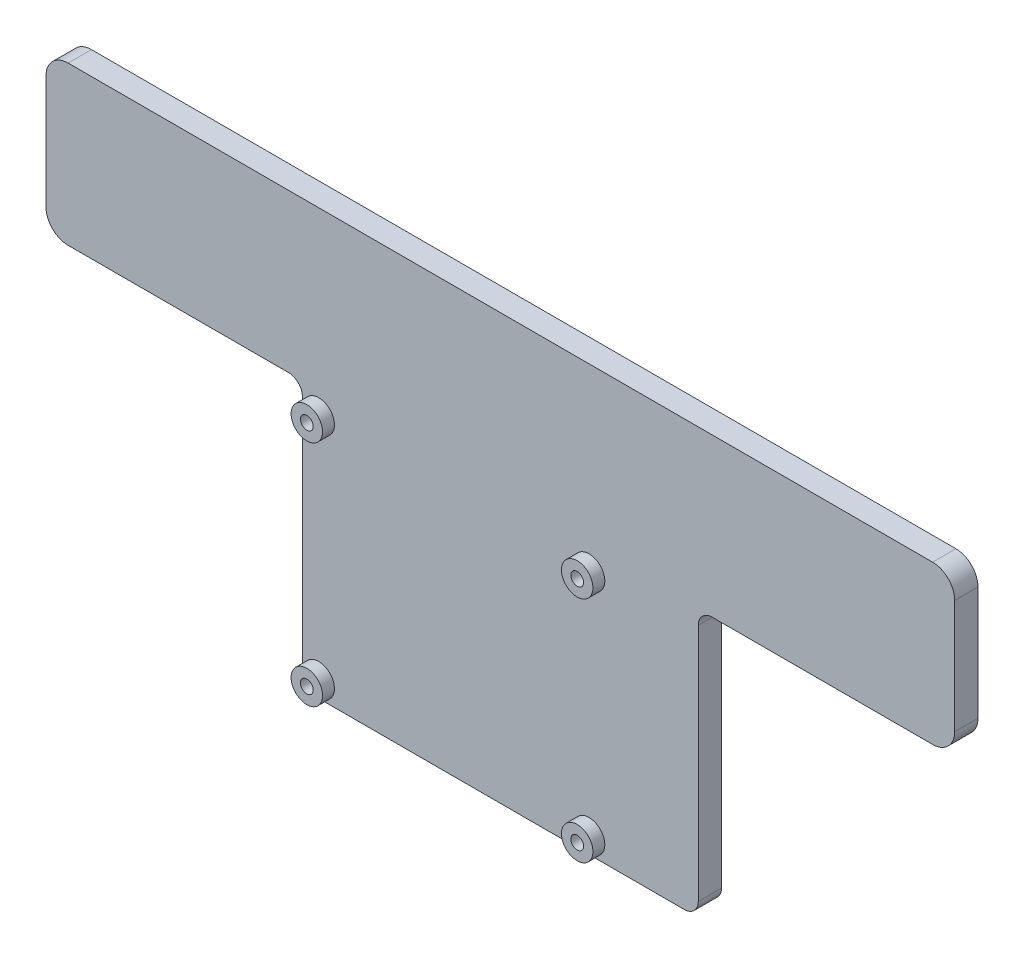
ISO-10303-21;
HEADER;
FILE_DESCRIPTION(('STEP AP214'),'2;1');
FILE_NAME('part.step','',(''),(''),'','','');
FILE_SCHEMA(('AUTOMOTIVE_DESIGN { 1 0 10303 214 1 1 1 1 }'));
ENDSEC;
DATA;
#1=APPLICATION_CONTEXT('core data for automotive mechanical design processes');
#2=APPLICATION_PROTOCOL_DEFINITION('international standard','automotive_design',2000,#1);
#3=PRODUCT_CONTEXT('',#1,'mechanical');
#4=PRODUCT('Part','Part','',(#3));
#5=PRODUCT_RELATED_PRODUCT_CATEGORY('part','',(#4));
#6=PRODUCT_DEFINITION_FORMATION('','',#4);
#7=PRODUCT_DEFINITION_CONTEXT('part definition',#1,'design');
#8=PRODUCT_DEFINITION('design','',#6,#7);
#9=PRODUCT_DEFINITION_SHAPE('','',#8);
#10=(LENGTH_UNIT() NAMED_UNIT(*) SI_UNIT(.MILLI.,.METRE.));
#11=(NAMED_UNIT(*) PLANE_ANGLE_UNIT() SI_UNIT($,.RADIAN.));
#12=(NAMED_UNIT(*) SI_UNIT($,.STERADIAN.) SOLID_ANGLE_UNIT());
#13=UNCERTAINTY_MEASURE_WITH_UNIT(LENGTH_MEASURE(1.E-05),#10,'distance_accuracy_value','');
#14=(GEOMETRIC_REPRESENTATION_CONTEXT(3) GLOBAL_UNCERTAINTY_ASSIGNED_CONTEXT((#13)) GLOBAL_UNIT_ASSIGNED_CONTEXT((#10,
#11,#12)) REPRESENTATION_CONTEXT('',''));
#15=CARTESIAN_POINT('',(0.,0.,0.));
#16=DIRECTION('',(0.,0.,1.));
#17=DIRECTION('',(1.,0.,0.));
#18=AXIS2_PLACEMENT_3D('',#15,#16,#17);
#19=CARTESIAN_POINT('',(-93.2870449166028,36.0396133550613,5.));
#20=DIRECTION('',(0.,0.,1.));
#21=DIRECTION('',(1.,0.,0.));
#22=AXIS2_PLACEMENT_3D('',#19,#20,#21);
#23=PLANE('',#22);
#24=CARTESIAN_POINT('',(18.4797248298251,-46.8878424310901,5.));
#25=DIRECTION('',(0.,0.,1.));
#26=DIRECTION('',(1.,0.,0.));
#27=AXIS2_PLACEMENT_3D('',#24,#25,#26);
#28=CIRCLE('',#27,3.375);
#29=CARTESIAN_POINT('',(21.8547248298251,-46.8878424310901,5.));
#30=VERTEX_POINT('',#29);
#31=EDGE_CURVE('E379',#30,#30,#28,.T.);
#32=ORIENTED_EDGE('',*,*,#31,.F.);
#33=EDGE_LOOP('',(#32));
#34=FACE_BOUND('',#33,.T.);
#35=CARTESIAN_POINT('',(-39.5202751701749,2.11215756890988,5.));
#36=DIRECTION('',(0.,0.,1.));
#37=DIRECTION('',(1.,0.,0.));
#38=AXIS2_PLACEMENT_3D('',#35,#36,#37);
#39=CIRCLE('',#38,3.375);
#40=CARTESIAN_POINT('',(-36.1452751701749,2.11215756890988,5.));
#41=VERTEX_POINT('',#40);
#42=EDGE_CURVE('E397',#41,#41,#39,.T.);
#43=ORIENTED_EDGE('',*,*,#42,.F.);
#44=EDGE_LOOP('',(#43));
#45=FACE_BOUND('',#44,.T.);
#46=CARTESIAN_POINT('',(-93.2870449166028,36.0396133550613,5.));
#47=DIRECTION('',(0.,0.,1.));
#48=DIRECTION('',(1.,0.,0.));
#49=AXIS2_PLACEMENT_3D('',#46,#47,#48);
#50=CIRCLE('',#49,4.742015780335);
#51=CARTESIAN_POINT('',(-93.2870449166028,40.7816291353963,5.));
#52=VERTEX_POINT('',#51);
#53=CARTESIAN_POINT('',(-98.0290606969378,36.0396133550613,5.));
#54=VERTEX_POINT('',#53);
#55=EDGE_CURVE('E208',#52,#54,#50,.T.);
#56=ORIENTED_EDGE('',*,*,#55,.T.);
#57=DIRECTION('',(0.,-1.,0.));
#58=VECTOR('',#57,1.);
#59=CARTESIAN_POINT('',(-98.0290606969378,36.0396133550613,5.));
#60=LINE('',#59,#58);
#61=CARTESIAN_POINT('',(-98.0290606969378,11.6587978675221,5.));
#62=VERTEX_POINT('',#61);
#63=EDGE_CURVE('E116',#54,#62,#60,.T.);
#64=ORIENTED_EDGE('',*,*,#63,.T.);
#65=CARTESIAN_POINT('',(-93.2870449166028,11.6587978675221,5.));
#66=DIRECTION('',(0.,0.,1.));
#67=DIRECTION('',(-1.,0.,0.));
#68=AXIS2_PLACEMENT_3D('',#65,#66,#67);
#69=CIRCLE('',#68,4.74201578033501);
#70=CARTESIAN_POINT('',(-93.2870449166028,6.91678208718709,5.));
#71=VERTEX_POINT('',#70);
#72=EDGE_CURVE('E247',#62,#71,#69,.T.);
#73=ORIENTED_EDGE('',*,*,#72,.T.);
#74=DIRECTION('',(1.,0.,0.));
#75=VECTOR('',#74,1.);
#76=CARTESIAN_POINT('',(-46.0202751701749,6.91678208718709,5.));
#77=LINE('',#76,#75);
#78=CARTESIAN_POINT('',(-46.0202751701749,6.9167820871871,5.));
#79=VERTEX_POINT('',#78);
#80=EDGE_CURVE('E266',#71,#79,#77,.T.);
#81=ORIENTED_EDGE('',*,*,#80,.T.);
#82=CARTESIAN_POINT('',(-46.0202751701749,3.9167820871871,5.));
#83=DIRECTION('',(0.,0.,-1.));
#84=DIRECTION('',(-1.,0.,0.));
#85=AXIS2_PLACEMENT_3D('',#82,#83,#84);
#86=CIRCLE('',#85,3.);
#87=CARTESIAN_POINT('',(-43.0202751701749,3.9167820871871,5.));
#88=VERTEX_POINT('',#87);
#89=EDGE_CURVE('E263',#79,#88,#86,.T.);
#90=ORIENTED_EDGE('',*,*,#89,.T.);
#91=DIRECTION('',(0.,-1.,0.));
#92=VECTOR('',#91,1.);
#93=CARTESIAN_POINT('',(-43.0202751701749,3.9167820871871,5.));
#94=LINE('',#93,#92);
#95=CARTESIAN_POINT('',(-43.0202751701749,-47.3878424310901,5.));
#96=VERTEX_POINT('',#95);
#97=EDGE_CURVE('E265',#88,#96,#94,.T.);
#98=ORIENTED_EDGE('',*,*,#97,.T.);
#99=CARTESIAN_POINT('',(-40.0202751701749,-47.3878424310901,5.));
#100=DIRECTION('',(0.,0.,1.));
#101=DIRECTION('',(-1.,0.,0.));
#102=AXIS2_PLACEMENT_3D('',#99,#100,#101);
#103=CIRCLE('',#102,2.99999999999999);
#104=CARTESIAN_POINT('',(-40.0202751701749,-50.3878424310901,5.));
#105=VERTEX_POINT('',#104);
#106=EDGE_CURVE('E268',#96,#105,#103,.T.);
#107=ORIENTED_EDGE('',*,*,#106,.T.);
#108=DIRECTION('',(1.,0.,0.));
#109=VECTOR('',#108,1.);
#110=CARTESIAN_POINT('',(38.9038921761908,-50.3878424310901,5.));
#111=LINE('',#110,#109);
#112=CARTESIAN_POINT('',(38.9038921761908,-50.3878424310901,5.));
#113=VERTEX_POINT('',#112);
#114=EDGE_CURVE('E274',#105,#113,#111,.T.);
#115=ORIENTED_EDGE('',*,*,#114,.T.);
#116=CARTESIAN_POINT('',(38.9038921761908,-47.3878424310901,5.));
#117=DIRECTION('',(0.,0.,1.));
#118=DIRECTION('',(1.,0.,0.));
#119=AXIS2_PLACEMENT_3D('',#116,#117,#118);
#120=CIRCLE('',#119,2.99999999999999);
#121=CARTESIAN_POINT('',(41.9038921761908,-47.3878424310901,5.));
#122=VERTEX_POINT('',#121);
#123=EDGE_CURVE('E276',#113,#122,#120,.T.);
#124=ORIENTED_EDGE('',*,*,#123,.T.);
#125=DIRECTION('',(0.,1.,0.));
#126=VECTOR('',#125,1.);
#127=CARTESIAN_POINT('',(41.9038921761908,-47.3878424310901,5.));
#128=LINE('',#127,#126);
#129=CARTESIAN_POINT('',(41.9038921761908,3.91678208718711,5.));
#130=VERTEX_POINT('',#129);
#131=EDGE_CURVE('E278',#122,#130,#128,.T.);
#132=ORIENTED_EDGE('',*,*,#131,.T.);
#133=CARTESIAN_POINT('',(44.9038921761908,3.91678208718711,5.));
#134=DIRECTION('',(0.,0.,-1.));
#135=DIRECTION('',(1.,0.,0.));
#136=AXIS2_PLACEMENT_3D('',#133,#134,#135);
#137=CIRCLE('',#136,3.);
#138=CARTESIAN_POINT('',(44.9038921761908,6.9167820871871,5.));
#139=VERTEX_POINT('',#138);
#140=EDGE_CURVE('E280',#130,#139,#137,.T.);
#141=ORIENTED_EDGE('',*,*,#140,.T.);
#142=DIRECTION('',(1.,0.,0.));
#143=VECTOR('',#142,1.);
#144=CARTESIAN_POINT('',(92.1706619226187,6.91678208718711,5.));
#145=LINE('',#144,#143);
#146=CARTESIAN_POINT('',(92.1706619226187,6.91678208718711,5.));
#147=VERTEX_POINT('',#146);
#148=EDGE_CURVE('E282',#139,#147,#145,.T.);
#149=ORIENTED_EDGE('',*,*,#148,.T.);
#150=CARTESIAN_POINT('',(92.1706619226187,11.6587978675221,5.));
#151=DIRECTION('',(0.,0.,1.));
#152=DIRECTION('',(1.,0.,0.));
#153=AXIS2_PLACEMENT_3D('',#150,#151,#152);
#154=CIRCLE('',#153,4.74201578033501);
#155=CARTESIAN_POINT('',(96.9126777029537,11.6587978675221,5.));
#156=VERTEX_POINT('',#155);
#157=EDGE_CURVE('E159',#147,#156,#154,.T.);
#158=ORIENTED_EDGE('',*,*,#157,.T.);
#159=DIRECTION('',(0.,1.,0.));
#160=VECTOR('',#159,1.);
#161=CARTESIAN_POINT('',(96.9126777029537,36.0396133550613,5.));
#162=LINE('',#161,#160);
#163=CARTESIAN_POINT('',(96.9126777029537,36.0396133550613,5.));
#164=VERTEX_POINT('',#163);
#165=EDGE_CURVE('E153',#156,#164,#162,.T.);
#166=ORIENTED_EDGE('',*,*,#165,.T.);
#167=CARTESIAN_POINT('',(92.1706619226187,36.0396133550613,5.));
#168=DIRECTION('',(0.,0.,1.));
#169=DIRECTION('',(-1.,0.,0.));
#170=AXIS2_PLACEMENT_3D('',#167,#168,#169);
#171=CIRCLE('',#170,4.742015780335);
#172=CARTESIAN_POINT('',(92.1706619226187,40.7816291353963,5.));
#173=VERTEX_POINT('',#172);
#174=EDGE_CURVE('E157',#164,#173,#171,.T.);
#175=ORIENTED_EDGE('',*,*,#174,.T.);
#176=DIRECTION('',(-1.,0.,0.));
#177=VECTOR('',#176,1.);
#178=CARTESIAN_POINT('',(-93.2870449166028,40.7816291353963,5.));
#179=LINE('',#178,#177);
#180=EDGE_CURVE('E49',#173,#52,#179,.T.);
#181=ORIENTED_EDGE('',*,*,#180,.T.);
#182=EDGE_LOOP('',(#56,#64,#73,#81,#90,#98,#107,#115,#124,#132,#141,#149,#158,#166,#175,#181));
#183=FACE_BOUND('',#182,.T.);
#184=CARTESIAN_POINT('',(18.4797248298251,2.11215756890988,5.));
#185=DIRECTION('',(0.,0.,1.));
#186=DIRECTION('',(1.,0.,0.));
#187=AXIS2_PLACEMENT_3D('',#184,#185,#186);
#188=CIRCLE('',#187,3.375);
#189=CARTESIAN_POINT('',(21.8547248298251,2.11215756890988,5.));
#190=VERTEX_POINT('',#189);
#191=EDGE_CURVE('E388',#190,#190,#188,.T.);
#192=ORIENTED_EDGE('',*,*,#191,.F.);
#193=EDGE_LOOP('',(#192));
#194=FACE_BOUND('',#193,.T.);
#195=CARTESIAN_POINT('',(-39.5202751701749,-46.8878424310901,5.));
#196=DIRECTION('',(0.,0.,1.));
#197=DIRECTION('',(1.,0.,0.));
#198=AXIS2_PLACEMENT_3D('',#195,#196,#197);
#199=CIRCLE('',#198,3.375);
#200=CARTESIAN_POINT('',(-36.1452751701749,-46.8878424310901,5.));
#201=VERTEX_POINT('',#200);
#202=EDGE_CURVE('E370',#201,#201,#199,.T.);
#203=ORIENTED_EDGE('',*,*,#202,.F.);
#204=EDGE_LOOP('',(#203));
#205=FACE_BOUND('',#204,.T.);
#206=ADVANCED_FACE('F32',(#34,#45,#183,#194,#205),#23,.T.);
#207=CARTESIAN_POINT('',(-93.2870449166028,36.0396133550613,0.));
#208=DIRECTION('',(0.,0.,1.));
#209=DIRECTION('',(1.,0.,0.));
#210=AXIS2_PLACEMENT_3D('',#207,#208,#209);
#211=PLANE('',#210);
#212=CARTESIAN_POINT('',(-93.2870449166028,36.0396133550613,0.));
#213=DIRECTION('',(0.,0.,1.));
#214=DIRECTION('',(1.,0.,0.));
#215=AXIS2_PLACEMENT_3D('',#212,#213,#214);
#216=CIRCLE('',#215,4.742015780335);
#217=CARTESIAN_POINT('',(-93.2870449166028,40.7816291353963,0.));
#218=VERTEX_POINT('',#217);
#219=CARTESIAN_POINT('',(-98.0290606969378,36.0396133550613,0.));
#220=VERTEX_POINT('',#219);
#221=EDGE_CURVE('E177',#218,#220,#216,.T.);
#222=ORIENTED_EDGE('',*,*,#221,.F.);
#223=DIRECTION('',(-1.,0.,0.));
#224=VECTOR('',#223,1.);
#225=CARTESIAN_POINT('',(-93.2870449166028,40.7816291353963,0.));
#226=LINE('',#225,#224);
#227=CARTESIAN_POINT('',(92.1706619226187,40.7816291353963,0.));
#228=VERTEX_POINT('',#227);
#229=EDGE_CURVE('E108',#228,#218,#226,.T.);
#230=ORIENTED_EDGE('',*,*,#229,.F.);
#231=CARTESIAN_POINT('',(92.1706619226187,36.0396133550613,0.));
#232=DIRECTION('',(0.,0.,1.));
#233=DIRECTION('',(-1.,0.,0.));
#234=AXIS2_PLACEMENT_3D('',#231,#232,#233);
#235=CIRCLE('',#234,4.742015780335);
#236=CARTESIAN_POINT('',(96.9126777029537,36.0396133550613,0.));
#237=VERTEX_POINT('',#236);
#238=EDGE_CURVE('E102',#237,#228,#235,.T.);
#239=ORIENTED_EDGE('',*,*,#238,.F.);
#240=DIRECTION('',(0.,1.,0.));
#241=VECTOR('',#240,1.);
#242=CARTESIAN_POINT('',(96.9126777029537,36.0396133550613,0.));
#243=LINE('',#242,#241);
#244=CARTESIAN_POINT('',(96.9126777029537,11.6587978675221,0.));
#245=VERTEX_POINT('',#244);
#246=EDGE_CURVE('E167',#245,#237,#243,.T.);
#247=ORIENTED_EDGE('',*,*,#246,.F.);
#248=CARTESIAN_POINT('',(92.1706619226187,11.6587978675221,0.));
#249=DIRECTION('',(0.,0.,1.));
#250=DIRECTION('',(1.,0.,0.));
#251=AXIS2_PLACEMENT_3D('',#248,#249,#250);
#252=CIRCLE('',#251,4.74201578033501);
#253=CARTESIAN_POINT('',(92.1706619226187,6.91678208718711,0.));
#254=VERTEX_POINT('',#253);
#255=EDGE_CURVE('E203',#254,#245,#252,.T.);
#256=ORIENTED_EDGE('',*,*,#255,.F.);
#257=DIRECTION('',(1.,0.,0.));
#258=VECTOR('',#257,1.);
#259=CARTESIAN_POINT('',(92.1706619226187,6.91678208718711,0.));
#260=LINE('',#259,#258);
#261=CARTESIAN_POINT('',(44.9038921761908,6.9167820871871,0.));
#262=VERTEX_POINT('',#261);
#263=EDGE_CURVE('E201',#262,#254,#260,.T.);
#264=ORIENTED_EDGE('',*,*,#263,.F.);
#265=CARTESIAN_POINT('',(44.9038921761908,3.91678208718711,0.));
#266=DIRECTION('',(0.,0.,-1.));
#267=DIRECTION('',(1.,0.,0.));
#268=AXIS2_PLACEMENT_3D('',#265,#266,#267);
#269=CIRCLE('',#268,3.);
#270=CARTESIAN_POINT('',(41.9038921761908,3.91678208718711,0.));
#271=VERTEX_POINT('',#270);
#272=EDGE_CURVE('E199',#271,#262,#269,.T.);
#273=ORIENTED_EDGE('',*,*,#272,.F.);
#274=DIRECTION('',(0.,1.,0.));
#275=VECTOR('',#274,1.);
#276=CARTESIAN_POINT('',(41.9038921761908,-47.3878424310901,0.));
#277=LINE('',#276,#275);
#278=CARTESIAN_POINT('',(41.9038921761908,-47.3878424310901,0.));
#279=VERTEX_POINT('',#278);
#280=EDGE_CURVE('E197',#279,#271,#277,.T.);
#281=ORIENTED_EDGE('',*,*,#280,.F.);
#282=CARTESIAN_POINT('',(38.9038921761908,-47.3878424310901,0.));
#283=DIRECTION('',(0.,0.,1.));
#284=DIRECTION('',(1.,0.,0.));
#285=AXIS2_PLACEMENT_3D('',#282,#283,#284);
#286=CIRCLE('',#285,2.99999999999999);
#287=CARTESIAN_POINT('',(38.9038921761908,-50.3878424310901,0.));
#288=VERTEX_POINT('',#287);
#289=EDGE_CURVE('E195',#288,#279,#286,.T.);
#290=ORIENTED_EDGE('',*,*,#289,.F.);
#291=DIRECTION('',(1.,0.,0.));
#292=VECTOR('',#291,1.);
#293=CARTESIAN_POINT('',(38.9038921761908,-50.3878424310901,0.));
#294=LINE('',#293,#292);
#295=CARTESIAN_POINT('',(-40.0202751701749,-50.3878424310901,0.));
#296=VERTEX_POINT('',#295);
#297=EDGE_CURVE('E193',#296,#288,#294,.T.);
#298=ORIENTED_EDGE('',*,*,#297,.F.);
#299=CARTESIAN_POINT('',(-40.0202751701749,-47.3878424310901,0.));
#300=DIRECTION('',(0.,0.,1.));
#301=DIRECTION('',(-1.,0.,0.));
#302=AXIS2_PLACEMENT_3D('',#299,#300,#301);
#303=CIRCLE('',#302,2.99999999999999);
#304=CARTESIAN_POINT('',(-43.0202751701749,-47.3878424310901,0.));
#305=VERTEX_POINT('',#304);
#306=EDGE_CURVE('E191',#305,#296,#303,.T.);
#307=ORIENTED_EDGE('',*,*,#306,.F.);
#308=DIRECTION('',(0.,-1.,0.));
#309=VECTOR('',#308,1.);
#310=CARTESIAN_POINT('',(-43.0202751701749,3.9167820871871,0.));
#311=LINE('',#310,#309);
#312=CARTESIAN_POINT('',(-43.0202751701749,3.9167820871871,0.));
#313=VERTEX_POINT('',#312);
#314=EDGE_CURVE('E189',#313,#305,#311,.T.);
#315=ORIENTED_EDGE('',*,*,#314,.F.);
#316=CARTESIAN_POINT('',(-46.0202751701749,3.9167820871871,0.));
#317=DIRECTION('',(0.,0.,-1.));
#318=DIRECTION('',(-1.,0.,0.));
#319=AXIS2_PLACEMENT_3D('',#316,#317,#318);
#320=CIRCLE('',#319,3.);
#321=CARTESIAN_POINT('',(-46.0202751701749,6.9167820871871,0.));
#322=VERTEX_POINT('',#321);
#323=EDGE_CURVE('E187',#322,#313,#320,.T.);
#324=ORIENTED_EDGE('',*,*,#323,.F.);
#325=DIRECTION('',(1.,0.,0.));
#326=VECTOR('',#325,1.);
#327=CARTESIAN_POINT('',(-46.0202751701749,6.91678208718709,0.));
#328=LINE('',#327,#326);
#329=CARTESIAN_POINT('',(-93.2870449166028,6.91678208718709,0.));
#330=VERTEX_POINT('',#329);
#331=EDGE_CURVE('E185',#330,#322,#328,.T.);
#332=ORIENTED_EDGE('',*,*,#331,.F.);
#333=CARTESIAN_POINT('',(-93.2870449166028,11.6587978675221,0.));
#334=DIRECTION('',(0.,0.,1.));
#335=DIRECTION('',(-1.,0.,0.));
#336=AXIS2_PLACEMENT_3D('',#333,#334,#335);
#337=CIRCLE('',#336,4.74201578033501);
#338=CARTESIAN_POINT('',(-98.0290606969378,11.6587978675221,0.));
#339=VERTEX_POINT('',#338);
#340=EDGE_CURVE('E183',#339,#330,#337,.T.);
#341=ORIENTED_EDGE('',*,*,#340,.F.);
#342=DIRECTION('',(0.,-1.,0.));
#343=VECTOR('',#342,1.);
#344=CARTESIAN_POINT('',(-98.0290606969378,36.0396133550613,0.));
#345=LINE('',#344,#343);
#346=EDGE_CURVE('E180',#220,#339,#345,.T.);
#347=ORIENTED_EDGE('',*,*,#346,.F.);
#348=EDGE_LOOP('',(#222,#230,#239,#247,#256,#264,#273,#281,#290,#298,#307,#315,#324,#332,#341,#347));
#349=FACE_BOUND('',#348,.T.);
#350=CARTESIAN_POINT('',(-39.5202751701749,2.11215756890988,0.));
#351=DIRECTION('',(0.,0.,1.));
#352=DIRECTION('',(1.,0.,0.));
#353=AXIS2_PLACEMENT_3D('',#350,#351,#352);
#354=CIRCLE('',#353,1.375);
#355=CARTESIAN_POINT('',(-38.1452751701749,2.11215756890988,0.));
#356=VERTEX_POINT('',#355);
#357=EDGE_CURVE('E181',#356,#356,#354,.T.);
#358=ORIENTED_EDGE('',*,*,#357,.T.);
#359=EDGE_LOOP('',(#358));
#360=FACE_BOUND('',#359,.T.);
#361=CARTESIAN_POINT('',(18.4797248298251,2.11215756890988,0.));
#362=DIRECTION('',(0.,0.,1.));
#363=DIRECTION('',(1.,0.,0.));
#364=AXIS2_PLACEMENT_3D('',#361,#362,#363);
#365=CIRCLE('',#364,1.375);
#366=CARTESIAN_POINT('',(19.8547248298251,2.11215756890988,0.));
#367=VERTEX_POINT('',#366);
#368=EDGE_CURVE('E409',#367,#367,#365,.T.);
#369=ORIENTED_EDGE('',*,*,#368,.T.);
#370=EDGE_LOOP('',(#369));
#371=FACE_BOUND('',#370,.T.);
#372=CARTESIAN_POINT('',(18.4797248298251,-46.8878424310901,0.));
#373=DIRECTION('',(0.,0.,1.));
#374=DIRECTION('',(1.,0.,0.));
#375=AXIS2_PLACEMENT_3D('',#372,#373,#374);
#376=CIRCLE('',#375,1.375);
#377=CARTESIAN_POINT('',(19.8547248298251,-46.8878424310901,0.));
#378=VERTEX_POINT('',#377);
#379=EDGE_CURVE('E406',#378,#378,#376,.T.);
#380=ORIENTED_EDGE('',*,*,#379,.T.);
#381=EDGE_LOOP('',(#380));
#382=FACE_BOUND('',#381,.T.);
#383=CARTESIAN_POINT('',(-39.5202751701749,-46.8878424310901,0.));
#384=DIRECTION('',(0.,0.,1.));
#385=DIRECTION('',(1.,0.,0.));
#386=AXIS2_PLACEMENT_3D('',#383,#384,#385);
#387=CIRCLE('',#386,1.375);
#388=CARTESIAN_POINT('',(-38.1452751701749,-46.8878424310901,0.));
#389=VERTEX_POINT('',#388);
#390=EDGE_CURVE('E401',#389,#389,#387,.T.);
#391=ORIENTED_EDGE('',*,*,#390,.T.);
#392=EDGE_LOOP('',(#391));
#393=FACE_BOUND('',#392,.T.);
#394=ADVANCED_FACE('F251',(#349,#360,#371,#382,#393),#211,.F.);
#395=CARTESIAN_POINT('',(-93.2870449166028,36.0396133550613,5.));
#396=DIRECTION('',(0.,0.,-1.));
#397=DIRECTION('',(-1.,0.,0.));
#398=AXIS2_PLACEMENT_3D('',#395,#396,#397);
#399=CYLINDRICAL_SURFACE('',#398,4.742015780335);
#400=ORIENTED_EDGE('',*,*,#221,.T.);
#401=DIRECTION('',(0.,0.,-1.));
#402=VECTOR('',#401,1.);
#403=CARTESIAN_POINT('',(-98.0290606969378,36.0396133550613,5.));
#404=LINE('',#403,#402);
#405=EDGE_CURVE('E11',#54,#220,#404,.T.);
#406=ORIENTED_EDGE('',*,*,#405,.F.);
#407=ORIENTED_EDGE('',*,*,#55,.F.);
#408=DIRECTION('',(0.,0.,-1.));
#409=VECTOR('',#408,1.);
#410=CARTESIAN_POINT('',(-93.2870449166028,40.7816291353963,5.));
#411=LINE('',#410,#409);
#412=EDGE_CURVE('E173',#52,#218,#411,.T.);
#413=ORIENTED_EDGE('',*,*,#412,.T.);
#414=EDGE_LOOP('',(#400,#406,#407,#413));
#415=FACE_BOUND('',#414,.T.);
#416=ADVANCED_FACE('F34',(#415),#399,.T.);
#417=CARTESIAN_POINT('',(-98.0290606969378,36.0396133550613,5.));
#418=DIRECTION('',(1.,0.,0.));
#419=DIRECTION('',(0.,1.,0.));
#420=AXIS2_PLACEMENT_3D('',#417,#418,#419);
#421=PLANE('',#420);
#422=ORIENTED_EDGE('',*,*,#346,.T.);
#423=DIRECTION('',(0.,0.,-1.));
#424=VECTOR('',#423,1.);
#425=CARTESIAN_POINT('',(-98.0290606969378,11.6587978675221,5.));
#426=LINE('',#425,#424);
#427=EDGE_CURVE('E41',#62,#339,#426,.T.);
#428=ORIENTED_EDGE('',*,*,#427,.F.);
#429=ORIENTED_EDGE('',*,*,#63,.F.);
#430=ORIENTED_EDGE('',*,*,#405,.T.);
#431=EDGE_LOOP('',(#422,#428,#429,#430));
#432=FACE_BOUND('',#431,.T.);
#433=ADVANCED_FACE('F634',(#432),#421,.F.);
#434=CARTESIAN_POINT('',(-93.2870449166028,11.6587978675221,5.));
#435=DIRECTION('',(0.,0.,-1.));
#436=DIRECTION('',(-1.,0.,0.));
#437=AXIS2_PLACEMENT_3D('',#434,#435,#436);
#438=CYLINDRICAL_SURFACE('',#437,4.74201578033501);
#439=ORIENTED_EDGE('',*,*,#340,.T.);
#440=DIRECTION('',(0.,0.,-1.));
#441=VECTOR('',#440,1.);
#442=CARTESIAN_POINT('',(-93.2870449166028,6.91678208718709,5.));
#443=LINE('',#442,#441);
#444=EDGE_CURVE('E239',#71,#330,#443,.T.);
#445=ORIENTED_EDGE('',*,*,#444,.F.);
#446=ORIENTED_EDGE('',*,*,#72,.F.);
#447=ORIENTED_EDGE('',*,*,#427,.T.);
#448=EDGE_LOOP('',(#439,#445,#446,#447));
#449=FACE_BOUND('',#448,.T.);
#450=ADVANCED_FACE('F245',(#449),#438,.T.);
#451=CARTESIAN_POINT('',(-46.0202751701749,6.91678208718709,5.));
#452=DIRECTION('',(0.,1.,0.));
#453=DIRECTION('',(-1.,0.,0.));
#454=AXIS2_PLACEMENT_3D('',#451,#452,#453);
#455=PLANE('',#454);
#456=ORIENTED_EDGE('',*,*,#331,.T.);
#457=DIRECTION('',(0.,0.,-1.));
#458=VECTOR('',#457,1.);
#459=CARTESIAN_POINT('',(-46.0202751701749,6.9167820871871,5.));
#460=LINE('',#459,#458);
#461=EDGE_CURVE('E236',#79,#322,#460,.T.);
#462=ORIENTED_EDGE('',*,*,#461,.F.);
#463=ORIENTED_EDGE('',*,*,#80,.F.);
#464=ORIENTED_EDGE('',*,*,#444,.T.);
#465=EDGE_LOOP('',(#456,#462,#463,#464));
#466=FACE_BOUND('',#465,.T.);
#467=ADVANCED_FACE('F257',(#466),#455,.F.);
#468=CARTESIAN_POINT('',(-46.0202751701749,3.9167820871871,5.));
#469=DIRECTION('',(0.,0.,-1.));
#470=DIRECTION('',(-1.,0.,0.));
#471=AXIS2_PLACEMENT_3D('',#468,#469,#470);
#472=CYLINDRICAL_SURFACE('',#471,3.);
#473=ORIENTED_EDGE('',*,*,#323,.T.);
#474=DIRECTION('',(0.,0.,-1.));
#475=VECTOR('',#474,1.);
#476=CARTESIAN_POINT('',(-43.0202751701749,3.9167820871871,5.));
#477=LINE('',#476,#475);
#478=EDGE_CURVE('E233',#88,#313,#477,.T.);
#479=ORIENTED_EDGE('',*,*,#478,.F.);
#480=ORIENTED_EDGE('',*,*,#89,.F.);
#481=ORIENTED_EDGE('',*,*,#461,.T.);
#482=EDGE_LOOP('',(#473,#479,#480,#481));
#483=FACE_BOUND('',#482,.T.);
#484=ADVANCED_FACE('F261',(#483),#472,.F.);
#485=CARTESIAN_POINT('',(-43.0202751701749,3.9167820871871,5.));
#486=DIRECTION('',(1.,0.,0.));
#487=DIRECTION('',(0.,1.,0.));
#488=AXIS2_PLACEMENT_3D('',#485,#486,#487);
#489=PLANE('',#488);
#490=ORIENTED_EDGE('',*,*,#314,.T.);
#491=DIRECTION('',(0.,0.,-1.));
#492=VECTOR('',#491,1.);
#493=CARTESIAN_POINT('',(-43.0202751701749,-47.3878424310901,5.));
#494=LINE('',#493,#492);
#495=EDGE_CURVE('E230',#96,#305,#494,.T.);
#496=ORIENTED_EDGE('',*,*,#495,.F.);
#497=ORIENTED_EDGE('',*,*,#97,.F.);
#498=ORIENTED_EDGE('',*,*,#478,.T.);
#499=EDGE_LOOP('',(#490,#496,#497,#498));
#500=FACE_BOUND('',#499,.T.);
#501=ADVANCED_FACE('F599',(#500),#489,.F.);
#502=CARTESIAN_POINT('',(-40.0202751701749,-47.3878424310901,5.));
#503=DIRECTION('',(0.,0.,-1.));
#504=DIRECTION('',(-1.,0.,0.));
#505=AXIS2_PLACEMENT_3D('',#502,#503,#504);
#506=CYLINDRICAL_SURFACE('',#505,2.99999999999999);
#507=ORIENTED_EDGE('',*,*,#306,.T.);
#508=DIRECTION('',(0.,0.,-1.));
#509=VECTOR('',#508,1.);
#510=CARTESIAN_POINT('',(-40.0202751701749,-50.3878424310901,5.));
#511=LINE('',#510,#509);
#512=EDGE_CURVE('E227',#105,#296,#511,.T.);
#513=ORIENTED_EDGE('',*,*,#512,.F.);
#514=ORIENTED_EDGE('',*,*,#106,.F.);
#515=ORIENTED_EDGE('',*,*,#495,.T.);
#516=EDGE_LOOP('',(#507,#513,#514,#515));
#517=FACE_BOUND('',#516,.T.);
#518=ADVANCED_FACE('F589',(#517),#506,.T.);
#519=CARTESIAN_POINT('',(38.9038921761908,-50.3878424310901,5.));
#520=DIRECTION('',(0.,1.,0.));
#521=DIRECTION('',(-1.,0.,0.));
#522=AXIS2_PLACEMENT_3D('',#519,#520,#521);
#523=PLANE('',#522);
#524=ORIENTED_EDGE('',*,*,#297,.T.);
#525=DIRECTION('',(0.,0.,-1.));
#526=VECTOR('',#525,1.);
#527=CARTESIAN_POINT('',(38.9038921761908,-50.3878424310901,5.));
#528=LINE('',#527,#526);
#529=EDGE_CURVE('E224',#113,#288,#528,.T.);
#530=ORIENTED_EDGE('',*,*,#529,.F.);
#531=ORIENTED_EDGE('',*,*,#114,.F.);
#532=ORIENTED_EDGE('',*,*,#512,.T.);
#533=EDGE_LOOP('',(#524,#530,#531,#532));
#534=FACE_BOUND('',#533,.T.);
#535=ADVANCED_FACE('F579',(#534),#523,.F.);
#536=CARTESIAN_POINT('',(38.9038921761908,-47.3878424310901,5.));
#537=DIRECTION('',(0.,0.,-1.));
#538=DIRECTION('',(-1.,0.,0.));
#539=AXIS2_PLACEMENT_3D('',#536,#537,#538);
#540=CYLINDRICAL_SURFACE('',#539,2.99999999999999);
#541=ORIENTED_EDGE('',*,*,#289,.T.);
#542=DIRECTION('',(0.,0.,-1.));
#543=VECTOR('',#542,1.);
#544=CARTESIAN_POINT('',(41.9038921761908,-47.3878424310901,5.));
#545=LINE('',#544,#543);
#546=EDGE_CURVE('E221',#122,#279,#545,.T.);
#547=ORIENTED_EDGE('',*,*,#546,.F.);
#548=ORIENTED_EDGE('',*,*,#123,.F.);
#549=ORIENTED_EDGE('',*,*,#529,.T.);
#550=EDGE_LOOP('',(#541,#547,#548,#549));
#551=FACE_BOUND('',#550,.T.);
#552=ADVANCED_FACE('F569',(#551),#540,.T.);
#553=CARTESIAN_POINT('',(41.9038921761908,-47.3878424310901,5.));
#554=DIRECTION('',(-1.,0.,0.));
#555=DIRECTION('',(0.,-1.,0.));
#556=AXIS2_PLACEMENT_3D('',#553,#554,#555);
#557=PLANE('',#556);
#558=ORIENTED_EDGE('',*,*,#280,.T.);
#559=DIRECTION('',(0.,0.,-1.));
#560=VECTOR('',#559,1.);
#561=CARTESIAN_POINT('',(41.9038921761908,3.91678208718711,5.));
#562=LINE('',#561,#560);
#563=EDGE_CURVE('E218',#130,#271,#562,.T.);
#564=ORIENTED_EDGE('',*,*,#563,.F.);
#565=ORIENTED_EDGE('',*,*,#131,.F.);
#566=ORIENTED_EDGE('',*,*,#546,.T.);
#567=EDGE_LOOP('',(#558,#564,#565,#566));
#568=FACE_BOUND('',#567,.T.);
#569=ADVANCED_FACE('F559',(#568),#557,.F.);
#570=CARTESIAN_POINT('',(44.9038921761908,3.91678208718711,5.));
#571=DIRECTION('',(0.,0.,-1.));
#572=DIRECTION('',(-1.,0.,0.));
#573=AXIS2_PLACEMENT_3D('',#570,#571,#572);
#574=CYLINDRICAL_SURFACE('',#573,3.);
#575=ORIENTED_EDGE('',*,*,#272,.T.);
#576=DIRECTION('',(0.,0.,-1.));
#577=VECTOR('',#576,1.);
#578=CARTESIAN_POINT('',(44.9038921761908,6.9167820871871,5.));
#579=LINE('',#578,#577);
#580=EDGE_CURVE('E215',#139,#262,#579,.T.);
#581=ORIENTED_EDGE('',*,*,#580,.F.);
#582=ORIENTED_EDGE('',*,*,#140,.F.);
#583=ORIENTED_EDGE('',*,*,#563,.T.);
#584=EDGE_LOOP('',(#575,#581,#582,#583));
#585=FACE_BOUND('',#584,.T.);
#586=ADVANCED_FACE('F550',(#585),#574,.F.);
#587=CARTESIAN_POINT('',(92.1706619226187,6.91678208718711,5.));
#588=DIRECTION('',(0.,1.,0.));
#589=DIRECTION('',(-1.,0.,0.));
#590=AXIS2_PLACEMENT_3D('',#587,#588,#589);
#591=PLANE('',#590);
#592=ORIENTED_EDGE('',*,*,#263,.T.);
#593=DIRECTION('',(0.,0.,-1.));
#594=VECTOR('',#593,1.);
#595=CARTESIAN_POINT('',(92.1706619226187,6.91678208718711,5.));
#596=LINE('',#595,#594);
#597=EDGE_CURVE('E212',#147,#254,#596,.T.);
#598=ORIENTED_EDGE('',*,*,#597,.F.);
#599=ORIENTED_EDGE('',*,*,#148,.F.);
#600=ORIENTED_EDGE('',*,*,#580,.T.);
#601=EDGE_LOOP('',(#592,#598,#599,#600));
#602=FACE_BOUND('',#601,.T.);
#603=ADVANCED_FACE('F288',(#602),#591,.F.);
#604=CARTESIAN_POINT('',(92.1706619226187,11.6587978675221,5.));
#605=DIRECTION('',(0.,0.,-1.));
#606=DIRECTION('',(-1.,0.,0.));
#607=AXIS2_PLACEMENT_3D('',#604,#605,#606);
#608=CYLINDRICAL_SURFACE('',#607,4.74201578033501);
#609=ORIENTED_EDGE('',*,*,#255,.T.);
#610=DIRECTION('',(0.,0.,-1.));
#611=VECTOR('',#610,1.);
#612=CARTESIAN_POINT('',(96.9126777029537,11.6587978675221,5.));
#613=LINE('',#612,#611);
#614=EDGE_CURVE('E168',#156,#245,#613,.T.);
#615=ORIENTED_EDGE('',*,*,#614,.F.);
#616=ORIENTED_EDGE('',*,*,#157,.F.);
#617=ORIENTED_EDGE('',*,*,#597,.T.);
#618=EDGE_LOOP('',(#609,#615,#616,#617));
#619=FACE_BOUND('',#618,.T.);
#620=ADVANCED_FACE('F292',(#619),#608,.T.);
#621=CARTESIAN_POINT('',(96.9126777029537,36.0396133550613,5.));
#622=DIRECTION('',(-1.,0.,0.));
#623=DIRECTION('',(0.,-1.,0.));
#624=AXIS2_PLACEMENT_3D('',#621,#622,#623);
#625=PLANE('',#624);
#626=ORIENTED_EDGE('',*,*,#246,.T.);
#627=DIRECTION('',(0.,0.,-1.));
#628=VECTOR('',#627,1.);
#629=CARTESIAN_POINT('',(96.9126777029537,36.0396133550613,5.));
#630=LINE('',#629,#628);
#631=EDGE_CURVE('E164',#164,#237,#630,.T.);
#632=ORIENTED_EDGE('',*,*,#631,.F.);
#633=ORIENTED_EDGE('',*,*,#165,.F.);
#634=ORIENTED_EDGE('',*,*,#614,.T.);
#635=EDGE_LOOP('',(#626,#632,#633,#634));
#636=FACE_BOUND('',#635,.T.);
#637=ADVANCED_FACE('F165',(#636),#625,.F.);
#638=CARTESIAN_POINT('',(92.1706619226187,36.0396133550613,5.));
#639=DIRECTION('',(0.,0.,-1.));
#640=DIRECTION('',(-1.,0.,0.));
#641=AXIS2_PLACEMENT_3D('',#638,#639,#640);
#642=CYLINDRICAL_SURFACE('',#641,4.742015780335);
#643=ORIENTED_EDGE('',*,*,#238,.T.);
#644=DIRECTION('',(0.,0.,-1.));
#645=VECTOR('',#644,1.);
#646=CARTESIAN_POINT('',(92.1706619226187,40.7816291353963,5.));
#647=LINE('',#646,#645);
#648=EDGE_CURVE('E169',#173,#228,#647,.T.);
#649=ORIENTED_EDGE('',*,*,#648,.F.);
#650=ORIENTED_EDGE('',*,*,#174,.F.);
#651=ORIENTED_EDGE('',*,*,#631,.T.);
#652=EDGE_LOOP('',(#643,#649,#650,#651));
#653=FACE_BOUND('',#652,.T.);
#654=ADVANCED_FACE('F171',(#653),#642,.T.);
#655=CARTESIAN_POINT('',(-93.2870449166028,40.7816291353963,5.));
#656=DIRECTION('',(0.,-1.,0.));
#657=DIRECTION('',(1.,0.,0.));
#658=AXIS2_PLACEMENT_3D('',#655,#656,#657);
#659=PLANE('',#658);
#660=ORIENTED_EDGE('',*,*,#229,.T.);
#661=ORIENTED_EDGE('',*,*,#412,.F.);
#662=ORIENTED_EDGE('',*,*,#180,.F.);
#663=ORIENTED_EDGE('',*,*,#648,.T.);
#664=EDGE_LOOP('',(#660,#661,#662,#663));
#665=FACE_BOUND('',#664,.T.);
#666=ADVANCED_FACE('F296',(#665),#659,.F.);
#667=CARTESIAN_POINT('',(-39.5202751701749,2.11215756890988,5.));
#668=DIRECTION('',(0.,0.,-1.));
#669=DIRECTION('',(-1.,0.,0.));
#670=AXIS2_PLACEMENT_3D('',#667,#668,#669);
#671=CYLINDRICAL_SURFACE('',#670,1.375);
#672=ORIENTED_EDGE('',*,*,#357,.F.);
#673=EDGE_LOOP('',(#672));
#674=FACE_BOUND('',#673,.T.);
#675=CARTESIAN_POINT('',(-39.5202751701749,2.11215756890988,7.55439585377317));
#676=DIRECTION('',(0.,0.,1.));
#677=DIRECTION('',(1.,0.,0.));
#678=AXIS2_PLACEMENT_3D('',#675,#676,#677);
#679=CIRCLE('',#678,1.375);
#680=CARTESIAN_POINT('',(-38.1452751701749,2.11215756890988,7.55439585377317));
#681=VERTEX_POINT('',#680);
#682=EDGE_CURVE('E392',#681,#681,#679,.T.);
#683=ORIENTED_EDGE('',*,*,#682,.T.);
#684=EDGE_LOOP('',(#683));
#685=FACE_BOUND('',#684,.T.);
#686=ADVANCED_FACE('F298',(#674,#685),#671,.F.);
#687=CARTESIAN_POINT('',(18.4797248298251,2.11215756890988,5.));
#688=DIRECTION('',(0.,0.,-1.));
#689=DIRECTION('',(-1.,0.,0.));
#690=AXIS2_PLACEMENT_3D('',#687,#688,#689);
#691=CYLINDRICAL_SURFACE('',#690,1.375);
#692=ORIENTED_EDGE('',*,*,#368,.F.);
#693=EDGE_LOOP('',(#692));
#694=FACE_BOUND('',#693,.T.);
#695=CARTESIAN_POINT('',(18.4797248298251,2.11215756890988,7.55439585377317));
#696=DIRECTION('',(0.,0.,1.));
#697=DIRECTION('',(1.,0.,0.));
#698=AXIS2_PLACEMENT_3D('',#695,#696,#697);
#699=CIRCLE('',#698,1.375);
#700=CARTESIAN_POINT('',(19.8547248298251,2.11215756890988,7.55439585377317));
#701=VERTEX_POINT('',#700);
#702=EDGE_CURVE('E383',#701,#701,#699,.T.);
#703=ORIENTED_EDGE('',*,*,#702,.T.);
#704=EDGE_LOOP('',(#703));
#705=FACE_BOUND('',#704,.T.);
#706=ADVANCED_FACE('F304',(#694,#705),#691,.F.);
#707=CARTESIAN_POINT('',(18.4797248298251,-46.8878424310901,5.));
#708=DIRECTION('',(0.,0.,-1.));
#709=DIRECTION('',(-1.,0.,0.));
#710=AXIS2_PLACEMENT_3D('',#707,#708,#709);
#711=CYLINDRICAL_SURFACE('',#710,1.375);
#712=ORIENTED_EDGE('',*,*,#379,.F.);
#713=EDGE_LOOP('',(#712));
#714=FACE_BOUND('',#713,.T.);
#715=CARTESIAN_POINT('',(18.4797248298251,-46.8878424310901,7.55439585377317));
#716=DIRECTION('',(0.,0.,1.));
#717=DIRECTION('',(1.,0.,0.));
#718=AXIS2_PLACEMENT_3D('',#715,#716,#717);
#719=CIRCLE('',#718,1.375);
#720=CARTESIAN_POINT('',(19.8547248298251,-46.8878424310901,7.55439585377317));
#721=VERTEX_POINT('',#720);
#722=EDGE_CURVE('E375',#721,#721,#719,.T.);
#723=ORIENTED_EDGE('',*,*,#722,.T.);
#724=EDGE_LOOP('',(#723));
#725=FACE_BOUND('',#724,.T.);
#726=ADVANCED_FACE('F320',(#714,#725),#711,.F.);
#727=CARTESIAN_POINT('',(-39.5202751701749,-46.8878424310901,5.));
#728=DIRECTION('',(0.,0.,-1.));
#729=DIRECTION('',(-1.,0.,0.));
#730=AXIS2_PLACEMENT_3D('',#727,#728,#729);
#731=CYLINDRICAL_SURFACE('',#730,1.375);
#732=ORIENTED_EDGE('',*,*,#390,.F.);
#733=EDGE_LOOP('',(#732));
#734=FACE_BOUND('',#733,.T.);
#735=CARTESIAN_POINT('',(-39.5202751701749,-46.8878424310901,7.55439585377317));
#736=DIRECTION('',(0.,0.,1.));
#737=DIRECTION('',(1.,0.,0.));
#738=AXIS2_PLACEMENT_3D('',#735,#736,#737);
#739=CIRCLE('',#738,1.375);
#740=CARTESIAN_POINT('',(-38.1452751701749,-46.8878424310901,7.55439585377317));
#741=VERTEX_POINT('',#740);
#742=EDGE_CURVE('E368',#741,#741,#739,.T.);
#743=ORIENTED_EDGE('',*,*,#742,.T.);
#744=EDGE_LOOP('',(#743));
#745=FACE_BOUND('',#744,.T.);
#746=ADVANCED_FACE('F324',(#734,#745),#731,.F.);
#747=CARTESIAN_POINT('',(-39.5202751701749,2.11215756890988,7.55439585377317));
#748=DIRECTION('',(0.,0.,1.));
#749=DIRECTION('',(1.,0.,0.));
#750=AXIS2_PLACEMENT_3D('',#747,#748,#749);
#751=PLANE('',#750);
#752=CARTESIAN_POINT('',(-39.5202751701749,2.11215756890988,7.55439585377317));
#753=DIRECTION('',(0.,0.,1.));
#754=DIRECTION('',(1.,0.,0.));
#755=AXIS2_PLACEMENT_3D('',#752,#753,#754);
#756=CIRCLE('',#755,3.375);
#757=CARTESIAN_POINT('',(-36.1452751701749,2.11215756890988,7.55439585377317));
#758=VERTEX_POINT('',#757);
#759=EDGE_CURVE('E398',#758,#758,#756,.T.);
#760=ORIENTED_EDGE('',*,*,#759,.T.);
#761=EDGE_LOOP('',(#760));
#762=FACE_BOUND('',#761,.T.);
#763=ORIENTED_EDGE('',*,*,#682,.F.);
#764=EDGE_LOOP('',(#763));
#765=FACE_BOUND('',#764,.T.);
#766=ADVANCED_FACE('F328',(#762,#765),#751,.T.);
#767=CARTESIAN_POINT('',(-39.5202751701749,2.11215756890988,7.55439585377317));
#768=DIRECTION('',(0.,0.,-1.));
#769=DIRECTION('',(-1.,0.,0.));
#770=AXIS2_PLACEMENT_3D('',#767,#768,#769);
#771=CYLINDRICAL_SURFACE('',#770,3.375);
#772=ORIENTED_EDGE('',*,*,#759,.F.);
#773=EDGE_LOOP('',(#772));
#774=FACE_BOUND('',#773,.T.);
#775=ORIENTED_EDGE('',*,*,#42,.T.);
#776=EDGE_LOOP('',(#775));
#777=FACE_BOUND('',#776,.T.);
#778=ADVANCED_FACE('F330',(#774,#777),#771,.T.);
#779=CARTESIAN_POINT('',(18.4797248298251,2.11215756890988,7.55439585377317));
#780=DIRECTION('',(0.,0.,1.));
#781=DIRECTION('',(1.,0.,0.));
#782=AXIS2_PLACEMENT_3D('',#779,#780,#781);
#783=PLANE('',#782);
#784=CARTESIAN_POINT('',(18.4797248298251,2.11215756890988,7.55439585377317));
#785=DIRECTION('',(0.,0.,1.));
#786=DIRECTION('',(1.,0.,0.));
#787=AXIS2_PLACEMENT_3D('',#784,#785,#786);
#788=CIRCLE('',#787,3.375);
#789=CARTESIAN_POINT('',(21.8547248298251,2.11215756890988,7.55439585377317));
#790=VERTEX_POINT('',#789);
#791=EDGE_CURVE('E389',#790,#790,#788,.T.);
#792=ORIENTED_EDGE('',*,*,#791,.T.);
#793=EDGE_LOOP('',(#792));
#794=FACE_BOUND('',#793,.T.);
#795=ORIENTED_EDGE('',*,*,#702,.F.);
#796=EDGE_LOOP('',(#795));
#797=FACE_BOUND('',#796,.T.);
#798=ADVANCED_FACE('F333',(#794,#797),#783,.T.);
#799=CARTESIAN_POINT('',(18.4797248298251,2.11215756890988,7.55439585377317));
#800=DIRECTION('',(0.,0.,-1.));
#801=DIRECTION('',(-1.,0.,0.));
#802=AXIS2_PLACEMENT_3D('',#799,#800,#801);
#803=CYLINDRICAL_SURFACE('',#802,3.375);
#804=ORIENTED_EDGE('',*,*,#791,.F.);
#805=EDGE_LOOP('',(#804));
#806=FACE_BOUND('',#805,.T.);
#807=ORIENTED_EDGE('',*,*,#191,.T.);
#808=EDGE_LOOP('',(#807));
#809=FACE_BOUND('',#808,.T.);
#810=ADVANCED_FACE('F338',(#806,#809),#803,.T.);
#811=CARTESIAN_POINT('',(18.4797248298251,-46.8878424310901,7.55439585377317));
#812=DIRECTION('',(0.,0.,1.));
#813=DIRECTION('',(1.,0.,0.));
#814=AXIS2_PLACEMENT_3D('',#811,#812,#813);
#815=PLANE('',#814);
#816=CARTESIAN_POINT('',(18.4797248298251,-46.8878424310901,7.55439585377317));
#817=DIRECTION('',(0.,0.,1.));
#818=DIRECTION('',(1.,0.,0.));
#819=AXIS2_PLACEMENT_3D('',#816,#817,#818);
#820=CIRCLE('',#819,3.375);
#821=CARTESIAN_POINT('',(21.8547248298251,-46.8878424310901,7.55439585377317));
#822=VERTEX_POINT('',#821);
#823=EDGE_CURVE('E380',#822,#822,#820,.T.);
#824=ORIENTED_EDGE('',*,*,#823,.T.);
#825=EDGE_LOOP('',(#824));
#826=FACE_BOUND('',#825,.T.);
#827=ORIENTED_EDGE('',*,*,#722,.F.);
#828=EDGE_LOOP('',(#827));
#829=FACE_BOUND('',#828,.T.);
#830=ADVANCED_FACE('F341',(#826,#829),#815,.T.);
#831=CARTESIAN_POINT('',(18.4797248298251,-46.8878424310901,7.55439585377317));
#832=DIRECTION('',(0.,0.,-1.));
#833=DIRECTION('',(-1.,0.,0.));
#834=AXIS2_PLACEMENT_3D('',#831,#832,#833);
#835=CYLINDRICAL_SURFACE('',#834,3.375);
#836=ORIENTED_EDGE('',*,*,#823,.F.);
#837=EDGE_LOOP('',(#836));
#838=FACE_BOUND('',#837,.T.);
#839=ORIENTED_EDGE('',*,*,#31,.T.);
#840=EDGE_LOOP('',(#839));
#841=FACE_BOUND('',#840,.T.);
#842=ADVANCED_FACE('F346',(#838,#841),#835,.T.);
#843=CARTESIAN_POINT('',(-39.5202751701749,-46.8878424310901,7.55439585377317));
#844=DIRECTION('',(0.,0.,1.));
#845=DIRECTION('',(1.,0.,0.));
#846=AXIS2_PLACEMENT_3D('',#843,#844,#845);
#847=PLANE('',#846);
#848=CARTESIAN_POINT('',(-39.5202751701749,-46.8878424310901,7.55439585377317));
#849=DIRECTION('',(0.,0.,1.));
#850=DIRECTION('',(1.,0.,0.));
#851=AXIS2_PLACEMENT_3D('',#848,#849,#850);
#852=CIRCLE('',#851,3.375);
#853=CARTESIAN_POINT('',(-36.1452751701749,-46.8878424310901,7.55439585377317));
#854=VERTEX_POINT('',#853);
#855=EDGE_CURVE('E365',#854,#854,#852,.T.);
#856=ORIENTED_EDGE('',*,*,#855,.T.);
#857=EDGE_LOOP('',(#856));
#858=FACE_BOUND('',#857,.T.);
#859=ORIENTED_EDGE('',*,*,#742,.F.);
#860=EDGE_LOOP('',(#859));
#861=FACE_BOUND('',#860,.T.);
#862=ADVANCED_FACE('F349',(#858,#861),#847,.T.);
#863=CARTESIAN_POINT('',(-39.5202751701749,-46.8878424310901,7.55439585377317));
#864=DIRECTION('',(0.,0.,-1.));
#865=DIRECTION('',(-1.,0.,0.));
#866=AXIS2_PLACEMENT_3D('',#863,#864,#865);
#867=CYLINDRICAL_SURFACE('',#866,3.375);
#868=ORIENTED_EDGE('',*,*,#855,.F.);
#869=EDGE_LOOP('',(#868));
#870=FACE_BOUND('',#869,.T.);
#871=ORIENTED_EDGE('',*,*,#202,.T.);
#872=EDGE_LOOP('',(#871));
#873=FACE_BOUND('',#872,.T.);
#874=ADVANCED_FACE('F354',(#870,#873),#867,.T.);
#875=CLOSED_SHELL('',(#206,#394,#416,#433,#450,#467,#484,#501,#518,#535,#552,#569,#586,#603,
#620,#637,#654,#666,#686,#706,#726,#746,#766,#778,#798,#810,#830,#842,#862,#874));
#876=MANIFOLD_SOLID_BREP('B2',#875);
#877=ADVANCED_BREP_SHAPE_REPRESENTATION('',(#18,#876),#14);
#878=SHAPE_DEFINITION_REPRESENTATION(#9,#877);
ENDSEC;
END-ISO-10303-21;
